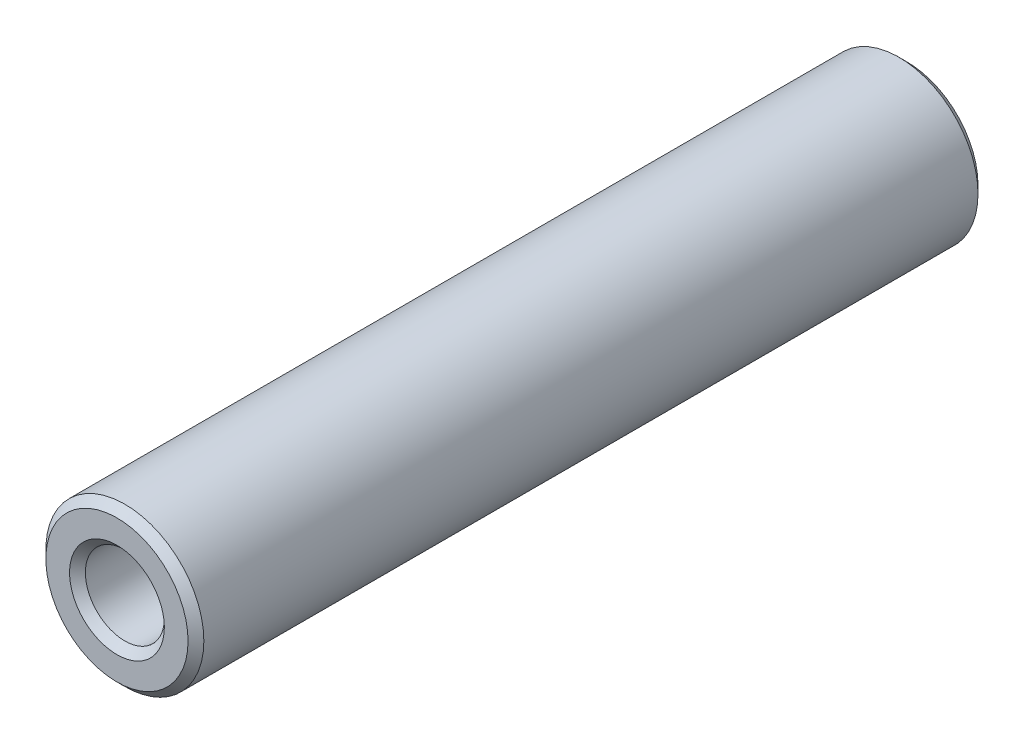
ISO-10303-21;
HEADER;
FILE_DESCRIPTION(('STEP AP214'),'2;1');
FILE_NAME('part.step','',(''),(''),'','','');
FILE_SCHEMA(('AUTOMOTIVE_DESIGN { 1 0 10303 214 1 1 1 1 }'));
ENDSEC;
DATA;
#1=APPLICATION_CONTEXT('core data for automotive mechanical design processes');
#2=APPLICATION_PROTOCOL_DEFINITION('international standard','automotive_design',2000,#1);
#3=PRODUCT_CONTEXT('',#1,'mechanical');
#4=PRODUCT('Part','Part','',(#3));
#5=PRODUCT_RELATED_PRODUCT_CATEGORY('part','',(#4));
#6=PRODUCT_DEFINITION_FORMATION('','',#4);
#7=PRODUCT_DEFINITION_CONTEXT('part definition',#1,'design');
#8=PRODUCT_DEFINITION('design','',#6,#7);
#9=PRODUCT_DEFINITION_SHAPE('','',#8);
#10=(LENGTH_UNIT() NAMED_UNIT(*) SI_UNIT(.MILLI.,.METRE.));
#11=(NAMED_UNIT(*) PLANE_ANGLE_UNIT() SI_UNIT($,.RADIAN.));
#12=(NAMED_UNIT(*) SI_UNIT($,.STERADIAN.) SOLID_ANGLE_UNIT());
#13=UNCERTAINTY_MEASURE_WITH_UNIT(LENGTH_MEASURE(1.E-05),#10,'distance_accuracy_value','');
#14=(GEOMETRIC_REPRESENTATION_CONTEXT(3) GLOBAL_UNCERTAINTY_ASSIGNED_CONTEXT((#13)) GLOBAL_UNIT_ASSIGNED_CONTEXT((#10,
#11,#12)) REPRESENTATION_CONTEXT('',''));
#15=CARTESIAN_POINT('',(0.,0.,0.));
#16=DIRECTION('',(0.,0.,1.));
#17=DIRECTION('',(1.,0.,0.));
#18=AXIS2_PLACEMENT_3D('',#15,#16,#17);
#19=CARTESIAN_POINT('',(0.,0.,20.));
#20=DIRECTION('',(0.,0.,1.));
#21=DIRECTION('',(1.,0.,0.));
#22=AXIS2_PLACEMENT_3D('',#19,#20,#21);
#23=PLANE('',#22);
#24=CARTESIAN_POINT('',(0.,0.,20.));
#25=DIRECTION('',(0.,0.,1.));
#26=DIRECTION('',(1.,0.,0.));
#27=AXIS2_PLACEMENT_3D('',#24,#25,#26);
#28=CIRCLE('',#27,1.2);
#29=CARTESIAN_POINT('',(1.2,0.,20.));
#30=VERTEX_POINT('',#29);
#31=EDGE_CURVE('E10',#30,#30,#28,.F.);
#32=ORIENTED_EDGE('',*,*,#31,.T.);
#33=EDGE_LOOP('',(#32));
#34=FACE_BOUND('',#33,.T.);
#35=CARTESIAN_POINT('',(0.,0.,20.));
#36=DIRECTION('',(0.,0.,1.));
#37=DIRECTION('',(1.,0.,0.));
#38=AXIS2_PLACEMENT_3D('',#35,#36,#37);
#39=CIRCLE('',#38,1.80000000000001);
#40=CARTESIAN_POINT('',(1.80000000000001,0.,20.));
#41=VERTEX_POINT('',#40);
#42=EDGE_CURVE('E39',#41,#41,#39,.T.);
#43=ORIENTED_EDGE('',*,*,#42,.T.);
#44=EDGE_LOOP('',(#43));
#45=FACE_BOUND('',#44,.T.);
#46=ADVANCED_FACE('F32',(#34,#45),#23,.T.);
#47=CARTESIAN_POINT('',(0.,0.,0.));
#48=DIRECTION('',(0.,0.,1.));
#49=DIRECTION('',(1.,0.,0.));
#50=AXIS2_PLACEMENT_3D('',#47,#48,#49);
#51=PLANE('',#50);
#52=CARTESIAN_POINT('',(0.,0.,0.));
#53=DIRECTION('',(0.,0.,1.));
#54=DIRECTION('',(1.,0.,0.));
#55=AXIS2_PLACEMENT_3D('',#52,#53,#54);
#56=CIRCLE('',#55,1.2);
#57=CARTESIAN_POINT('',(1.2,0.,0.));
#58=VERTEX_POINT('',#57);
#59=EDGE_CURVE('E58',#58,#58,#56,.T.);
#60=ORIENTED_EDGE('',*,*,#59,.T.);
#61=EDGE_LOOP('',(#60));
#62=FACE_BOUND('',#61,.T.);
#63=CARTESIAN_POINT('',(0.,0.,0.));
#64=DIRECTION('',(0.,0.,1.));
#65=DIRECTION('',(1.,0.,0.));
#66=AXIS2_PLACEMENT_3D('',#63,#64,#65);
#67=CIRCLE('',#66,1.8);
#68=CARTESIAN_POINT('',(1.8,0.,0.));
#69=VERTEX_POINT('',#68);
#70=EDGE_CURVE('E61',#69,#69,#67,.F.);
#71=ORIENTED_EDGE('',*,*,#70,.T.);
#72=EDGE_LOOP('',(#71));
#73=FACE_BOUND('',#72,.T.);
#74=ADVANCED_FACE('F65',(#62,#73),#51,.F.);
#75=CARTESIAN_POINT('',(0.,0.,20.));
#76=DIRECTION('',(0.,0.,-1.));
#77=DIRECTION('',(-1.,0.,0.));
#78=AXIS2_PLACEMENT_3D('',#75,#76,#77);
#79=CYLINDRICAL_SURFACE('',#78,2.);
#80=CARTESIAN_POINT('',(0.,0.,0.199999999999995));
#81=DIRECTION('',(0.,0.,1.));
#82=DIRECTION('',(1.,0.,0.));
#83=AXIS2_PLACEMENT_3D('',#80,#81,#82);
#84=CIRCLE('',#83,2.);
#85=CARTESIAN_POINT('',(2.,0.,0.199999999999995));
#86=VERTEX_POINT('',#85);
#87=EDGE_CURVE('E43',#86,#86,#84,.T.);
#88=ORIENTED_EDGE('',*,*,#87,.T.);
#89=EDGE_LOOP('',(#88));
#90=FACE_BOUND('',#89,.T.);
#91=CARTESIAN_POINT('',(0.,0.,19.8));
#92=DIRECTION('',(0.,0.,1.));
#93=DIRECTION('',(1.,0.,0.));
#94=AXIS2_PLACEMENT_3D('',#91,#92,#93);
#95=CIRCLE('',#94,2.);
#96=CARTESIAN_POINT('',(2.,0.,19.8));
#97=VERTEX_POINT('',#96);
#98=EDGE_CURVE('E47',#97,#97,#95,.F.);
#99=ORIENTED_EDGE('',*,*,#98,.T.);
#100=EDGE_LOOP('',(#99));
#101=FACE_BOUND('',#100,.T.);
#102=ADVANCED_FACE('F75',(#90,#101),#79,.T.);
#103=CARTESIAN_POINT('',(0.,0.,20.));
#104=DIRECTION('',(0.,0.,-1.));
#105=DIRECTION('',(-1.,0.,0.));
#106=AXIS2_PLACEMENT_3D('',#103,#104,#105);
#107=CYLINDRICAL_SURFACE('',#106,0.999999999999999);
#108=CARTESIAN_POINT('',(0.,0.,0.199999999999999));
#109=DIRECTION('',(0.,0.,1.));
#110=DIRECTION('',(1.,0.,0.));
#111=AXIS2_PLACEMENT_3D('',#108,#109,#110);
#112=CIRCLE('',#111,0.999999999999999);
#113=CARTESIAN_POINT('',(0.999999999999999,0.,0.199999999999999));
#114=VERTEX_POINT('',#113);
#115=EDGE_CURVE('E52',#114,#114,#112,.F.);
#116=ORIENTED_EDGE('',*,*,#115,.T.);
#117=EDGE_LOOP('',(#116));
#118=FACE_BOUND('',#117,.T.);
#119=CARTESIAN_POINT('',(0.,0.,19.8));
#120=DIRECTION('',(0.,0.,1.));
#121=DIRECTION('',(1.,0.,0.));
#122=AXIS2_PLACEMENT_3D('',#119,#120,#121);
#123=CIRCLE('',#122,0.999999999999999);
#124=CARTESIAN_POINT('',(0.999999999999999,0.,19.8));
#125=VERTEX_POINT('',#124);
#126=EDGE_CURVE('E55',#125,#125,#123,.T.);
#127=ORIENTED_EDGE('',*,*,#126,.T.);
#128=EDGE_LOOP('',(#127));
#129=FACE_BOUND('',#128,.T.);
#130=ADVANCED_FACE('F78',(#118,#129),#107,.F.);
#131=CARTESIAN_POINT('',(0.,0.,0.));
#132=DIRECTION('',(0.,0.,-1.));
#133=DIRECTION('',(-1.,0.,0.));
#134=AXIS2_PLACEMENT_3D('',#131,#132,#133);
#135=CONICAL_SURFACE('',#134,1.2,0.785398163397448);
#136=ORIENTED_EDGE('',*,*,#115,.F.);
#137=EDGE_LOOP('',(#136));
#138=FACE_BOUND('',#137,.T.);
#139=ORIENTED_EDGE('',*,*,#59,.F.);
#140=EDGE_LOOP('',(#139));
#141=FACE_BOUND('',#140,.T.);
#142=ADVANCED_FACE('F71',(#138,#141),#135,.F.);
#143=CARTESIAN_POINT('',(0.,0.,0.199999999999995));
#144=DIRECTION('',(0.,0.,1.));
#145=DIRECTION('',(1.,0.,0.));
#146=AXIS2_PLACEMENT_3D('',#143,#144,#145);
#147=CONICAL_SURFACE('',#146,2.,0.785398163397457);
#148=ORIENTED_EDGE('',*,*,#70,.F.);
#149=EDGE_LOOP('',(#148));
#150=FACE_BOUND('',#149,.T.);
#151=ORIENTED_EDGE('',*,*,#87,.F.);
#152=EDGE_LOOP('',(#151));
#153=FACE_BOUND('',#152,.T.);
#154=ADVANCED_FACE('F67',(#150,#153),#147,.T.);
#155=CARTESIAN_POINT('',(0.,0.,19.8));
#156=DIRECTION('',(0.,0.,1.));
#157=DIRECTION('',(1.,0.,0.));
#158=AXIS2_PLACEMENT_3D('',#155,#156,#157);
#159=CONICAL_SURFACE('',#158,0.999999999999999,0.785398163397448);
#160=ORIENTED_EDGE('',*,*,#31,.F.);
#161=EDGE_LOOP('',(#160));
#162=FACE_BOUND('',#161,.T.);
#163=ORIENTED_EDGE('',*,*,#126,.F.);
#164=EDGE_LOOP('',(#163));
#165=FACE_BOUND('',#164,.T.);
#166=ADVANCED_FACE('F70',(#162,#165),#159,.F.);
#167=CARTESIAN_POINT('',(0.,0.,20.));
#168=DIRECTION('',(0.,0.,-1.));
#169=DIRECTION('',(-1.,0.,0.));
#170=AXIS2_PLACEMENT_3D('',#167,#168,#169);
#171=CONICAL_SURFACE('',#170,1.80000000000001,0.785398163397444);
#172=ORIENTED_EDGE('',*,*,#98,.F.);
#173=EDGE_LOOP('',(#172));
#174=FACE_BOUND('',#173,.T.);
#175=ORIENTED_EDGE('',*,*,#42,.F.);
#176=EDGE_LOOP('',(#175));
#177=FACE_BOUND('',#176,.T.);
#178=ADVANCED_FACE('F34',(#174,#177),#171,.T.);
#179=CLOSED_SHELL('',(#46,#74,#102,#130,#142,#154,#166,#178));
#180=MANIFOLD_SOLID_BREP('B2',#179);
#181=ADVANCED_BREP_SHAPE_REPRESENTATION('',(#18,#180),#14);
#182=SHAPE_DEFINITION_REPRESENTATION(#9,#181);
ENDSEC;
END-ISO-10303-21;
